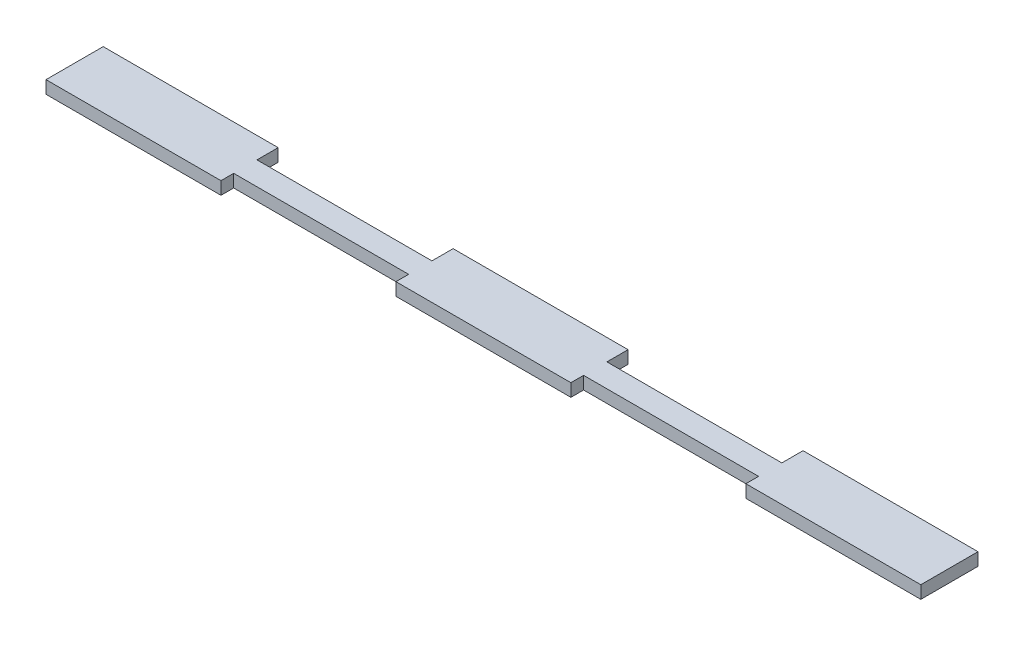
ISO-10303-21;
HEADER;
FILE_DESCRIPTION(('STEP AP214'),'2;1');
FILE_NAME('part.step','',(''),(''),'','','');
FILE_SCHEMA(('AUTOMOTIVE_DESIGN { 1 0 10303 214 1 1 1 1 }'));
ENDSEC;
DATA;
#1=APPLICATION_CONTEXT('core data for automotive mechanical design processes');
#2=APPLICATION_PROTOCOL_DEFINITION('international standard','automotive_design',2000,#1);
#3=PRODUCT_CONTEXT('',#1,'mechanical');
#4=PRODUCT('Part','Part','',(#3));
#5=PRODUCT_RELATED_PRODUCT_CATEGORY('part','',(#4));
#6=PRODUCT_DEFINITION_FORMATION('','',#4);
#7=PRODUCT_DEFINITION_CONTEXT('part definition',#1,'design');
#8=PRODUCT_DEFINITION('design','',#6,#7);
#9=PRODUCT_DEFINITION_SHAPE('','',#8);
#10=(LENGTH_UNIT() NAMED_UNIT(*) SI_UNIT(.MILLI.,.METRE.));
#11=(NAMED_UNIT(*) PLANE_ANGLE_UNIT() SI_UNIT($,.RADIAN.));
#12=(NAMED_UNIT(*) SI_UNIT($,.STERADIAN.) SOLID_ANGLE_UNIT());
#13=UNCERTAINTY_MEASURE_WITH_UNIT(LENGTH_MEASURE(1.E-05),#10,'distance_accuracy_value','');
#14=(GEOMETRIC_REPRESENTATION_CONTEXT(3) GLOBAL_UNCERTAINTY_ASSIGNED_CONTEXT((#13)) GLOBAL_UNIT_ASSIGNED_CONTEXT((#10,
#11,#12)) REPRESENTATION_CONTEXT('',''));
#15=CARTESIAN_POINT('',(0.,0.,0.));
#16=DIRECTION('',(0.,0.,1.));
#17=DIRECTION('',(1.,0.,0.));
#18=AXIS2_PLACEMENT_3D('',#15,#16,#17);
#19=CARTESIAN_POINT('',(61.9499999999999,3.,6.75));
#20=DIRECTION('',(0.,0.,-1.));
#21=DIRECTION('',(-1.,0.,0.));
#22=AXIS2_PLACEMENT_3D('',#19,#20,#21);
#23=PLANE('',#22);
#24=DIRECTION('',(1.,0.,0.));
#25=VECTOR('',#24,1.);
#26=CARTESIAN_POINT('',(61.9499999999999,0.,6.75));
#27=LINE('',#26,#25);
#28=CARTESIAN_POINT('',(61.9499999999999,0.,6.75));
#29=VERTEX_POINT('',#28);
#30=CARTESIAN_POINT('',(103.25,0.,6.75));
#31=VERTEX_POINT('',#30);
#32=EDGE_CURVE('E201',#29,#31,#27,.T.);
#33=ORIENTED_EDGE('',*,*,#32,.T.);
#34=DIRECTION('',(0.,-1.,0.));
#35=VECTOR('',#34,1.);
#36=CARTESIAN_POINT('',(103.25,3.,6.75));
#37=LINE('',#36,#35);
#38=CARTESIAN_POINT('',(103.25,3.,6.75));
#39=VERTEX_POINT('',#38);
#40=EDGE_CURVE('E11',#39,#31,#37,.T.);
#41=ORIENTED_EDGE('',*,*,#40,.F.);
#42=DIRECTION('',(1.,0.,0.));
#43=VECTOR('',#42,1.);
#44=CARTESIAN_POINT('',(61.9499999999999,3.,6.75));
#45=LINE('',#44,#43);
#46=CARTESIAN_POINT('',(61.9499999999999,3.,6.75));
#47=VERTEX_POINT('',#46);
#48=EDGE_CURVE('E239',#47,#39,#45,.T.);
#49=ORIENTED_EDGE('',*,*,#48,.F.);
#50=DIRECTION('',(0.,-1.,0.));
#51=VECTOR('',#50,1.);
#52=CARTESIAN_POINT('',(61.9499999999999,3.,6.75));
#53=LINE('',#52,#51);
#54=EDGE_CURVE('E197',#47,#29,#53,.T.);
#55=ORIENTED_EDGE('',*,*,#54,.T.);
#56=EDGE_LOOP('',(#33,#41,#49,#55));
#57=FACE_BOUND('',#56,.T.);
#58=ADVANCED_FACE('F33',(#57),#23,.F.);
#59=CARTESIAN_POINT('',(103.25,3.,-6.75));
#60=DIRECTION('',(-1.,0.,0.));
#61=DIRECTION('',(0.,0.,1.));
#62=AXIS2_PLACEMENT_3D('',#59,#60,#61);
#63=PLANE('',#62);
#64=DIRECTION('',(0.,0.,-1.));
#65=VECTOR('',#64,1.);
#66=CARTESIAN_POINT('',(103.25,0.,-6.75));
#67=LINE('',#66,#65);
#68=CARTESIAN_POINT('',(103.25,0.,-6.75));
#69=VERTEX_POINT('',#68);
#70=EDGE_CURVE('E204',#31,#69,#67,.T.);
#71=ORIENTED_EDGE('',*,*,#70,.T.);
#72=DIRECTION('',(0.,-1.,0.));
#73=VECTOR('',#72,1.);
#74=CARTESIAN_POINT('',(103.25,3.,-6.75));
#75=LINE('',#74,#73);
#76=CARTESIAN_POINT('',(103.25,3.,-6.75));
#77=VERTEX_POINT('',#76);
#78=EDGE_CURVE('E41',#77,#69,#75,.T.);
#79=ORIENTED_EDGE('',*,*,#78,.F.);
#80=DIRECTION('',(0.,0.,-1.));
#81=VECTOR('',#80,1.);
#82=CARTESIAN_POINT('',(103.25,3.,-6.75));
#83=LINE('',#82,#81);
#84=EDGE_CURVE('E128',#39,#77,#83,.T.);
#85=ORIENTED_EDGE('',*,*,#84,.F.);
#86=ORIENTED_EDGE('',*,*,#40,.T.);
#87=EDGE_LOOP('',(#71,#79,#85,#86));
#88=FACE_BOUND('',#87,.T.);
#89=ADVANCED_FACE('F357',(#88),#63,.F.);
#90=CARTESIAN_POINT('',(61.9499999999999,3.,-6.75));
#91=DIRECTION('',(0.,0.,1.));
#92=DIRECTION('',(1.,0.,0.));
#93=AXIS2_PLACEMENT_3D('',#90,#91,#92);
#94=PLANE('',#93);
#95=DIRECTION('',(-1.,0.,0.));
#96=VECTOR('',#95,1.);
#97=CARTESIAN_POINT('',(61.9499999999999,0.,-6.75));
#98=LINE('',#97,#96);
#99=CARTESIAN_POINT('',(61.9499999999999,0.,-6.75));
#100=VERTEX_POINT('',#99);
#101=EDGE_CURVE('E206',#69,#100,#98,.T.);
#102=ORIENTED_EDGE('',*,*,#101,.T.);
#103=DIRECTION('',(0.,-1.,0.));
#104=VECTOR('',#103,1.);
#105=CARTESIAN_POINT('',(61.9499999999999,3.,-6.75));
#106=LINE('',#105,#104);
#107=CARTESIAN_POINT('',(61.9499999999999,3.,-6.75));
#108=VERTEX_POINT('',#107);
#109=EDGE_CURVE('E282',#108,#100,#106,.T.);
#110=ORIENTED_EDGE('',*,*,#109,.F.);
#111=DIRECTION('',(-1.,0.,0.));
#112=VECTOR('',#111,1.);
#113=CARTESIAN_POINT('',(61.9499999999999,3.,-6.75));
#114=LINE('',#113,#112);
#115=EDGE_CURVE('E290',#77,#108,#114,.T.);
#116=ORIENTED_EDGE('',*,*,#115,.F.);
#117=ORIENTED_EDGE('',*,*,#78,.T.);
#118=EDGE_LOOP('',(#102,#110,#116,#117));
#119=FACE_BOUND('',#118,.T.);
#120=ADVANCED_FACE('F288',(#119),#94,.F.);
#121=CARTESIAN_POINT('',(61.9499999999999,3.,-6.75));
#122=DIRECTION('',(1.,0.,0.));
#123=DIRECTION('',(0.,0.,-1.));
#124=AXIS2_PLACEMENT_3D('',#121,#122,#123);
#125=PLANE('',#124);
#126=DIRECTION('',(0.,0.,1.));
#127=VECTOR('',#126,1.);
#128=CARTESIAN_POINT('',(61.9499999999999,0.,-6.75));
#129=LINE('',#128,#127);
#130=CARTESIAN_POINT('',(61.9499999999999,0.,-1.75));
#131=VERTEX_POINT('',#130);
#132=EDGE_CURVE('E208',#100,#131,#129,.T.);
#133=ORIENTED_EDGE('',*,*,#132,.T.);
#134=DIRECTION('',(0.,-1.,0.));
#135=VECTOR('',#134,1.);
#136=CARTESIAN_POINT('',(61.9499999999999,3.,-1.75));
#137=LINE('',#136,#135);
#138=CARTESIAN_POINT('',(61.9499999999999,3.,-1.75));
#139=VERTEX_POINT('',#138);
#140=EDGE_CURVE('E279',#139,#131,#137,.T.);
#141=ORIENTED_EDGE('',*,*,#140,.F.);
#142=DIRECTION('',(0.,0.,1.));
#143=VECTOR('',#142,1.);
#144=CARTESIAN_POINT('',(61.9499999999999,3.,-6.75));
#145=LINE('',#144,#143);
#146=EDGE_CURVE('E308',#108,#139,#145,.T.);
#147=ORIENTED_EDGE('',*,*,#146,.F.);
#148=ORIENTED_EDGE('',*,*,#109,.T.);
#149=EDGE_LOOP('',(#133,#141,#147,#148));
#150=FACE_BOUND('',#149,.T.);
#151=ADVANCED_FACE('F299',(#150),#125,.F.);
#152=CARTESIAN_POINT('',(20.65,3.,-1.75));
#153=DIRECTION('',(0.,0.,1.));
#154=DIRECTION('',(1.,0.,0.));
#155=AXIS2_PLACEMENT_3D('',#152,#153,#154);
#156=PLANE('',#155);
#157=DIRECTION('',(-1.,0.,0.));
#158=VECTOR('',#157,1.);
#159=CARTESIAN_POINT('',(20.65,0.,-1.75));
#160=LINE('',#159,#158);
#161=CARTESIAN_POINT('',(20.65,0.,-1.75));
#162=VERTEX_POINT('',#161);
#163=EDGE_CURVE('E210',#131,#162,#160,.T.);
#164=ORIENTED_EDGE('',*,*,#163,.T.);
#165=DIRECTION('',(0.,-1.,0.));
#166=VECTOR('',#165,1.);
#167=CARTESIAN_POINT('',(20.65,3.,-1.75));
#168=LINE('',#167,#166);
#169=CARTESIAN_POINT('',(20.65,3.,-1.75));
#170=VERTEX_POINT('',#169);
#171=EDGE_CURVE('E276',#170,#162,#168,.T.);
#172=ORIENTED_EDGE('',*,*,#171,.F.);
#173=DIRECTION('',(-1.,0.,0.));
#174=VECTOR('',#173,1.);
#175=CARTESIAN_POINT('',(20.65,3.,-1.75));
#176=LINE('',#175,#174);
#177=EDGE_CURVE('E305',#139,#170,#176,.T.);
#178=ORIENTED_EDGE('',*,*,#177,.F.);
#179=ORIENTED_EDGE('',*,*,#140,.T.);
#180=EDGE_LOOP('',(#164,#172,#178,#179));
#181=FACE_BOUND('',#180,.T.);
#182=ADVANCED_FACE('F303',(#181),#156,.F.);
#183=CARTESIAN_POINT('',(20.65,3.,-6.75));
#184=DIRECTION('',(-1.,0.,0.));
#185=DIRECTION('',(0.,0.,1.));
#186=AXIS2_PLACEMENT_3D('',#183,#184,#185);
#187=PLANE('',#186);
#188=DIRECTION('',(0.,0.,-1.));
#189=VECTOR('',#188,1.);
#190=CARTESIAN_POINT('',(20.65,0.,-6.75));
#191=LINE('',#190,#189);
#192=CARTESIAN_POINT('',(20.65,0.,-6.75));
#193=VERTEX_POINT('',#192);
#194=EDGE_CURVE('E212',#162,#193,#191,.T.);
#195=ORIENTED_EDGE('',*,*,#194,.T.);
#196=DIRECTION('',(0.,-1.,0.));
#197=VECTOR('',#196,1.);
#198=CARTESIAN_POINT('',(20.65,3.,-6.75));
#199=LINE('',#198,#197);
#200=CARTESIAN_POINT('',(20.65,3.,-6.75));
#201=VERTEX_POINT('',#200);
#202=EDGE_CURVE('E273',#201,#193,#199,.T.);
#203=ORIENTED_EDGE('',*,*,#202,.F.);
#204=DIRECTION('',(0.,0.,-1.));
#205=VECTOR('',#204,1.);
#206=CARTESIAN_POINT('',(20.65,3.,-6.75));
#207=LINE('',#206,#205);
#208=EDGE_CURVE('E307',#170,#201,#207,.T.);
#209=ORIENTED_EDGE('',*,*,#208,.F.);
#210=ORIENTED_EDGE('',*,*,#171,.T.);
#211=EDGE_LOOP('',(#195,#203,#209,#210));
#212=FACE_BOUND('',#211,.T.);
#213=ADVANCED_FACE('F370',(#212),#187,.F.);
#214=CARTESIAN_POINT('',(-20.65,3.,-6.75));
#215=DIRECTION('',(0.,0.,1.));
#216=DIRECTION('',(1.,0.,0.));
#217=AXIS2_PLACEMENT_3D('',#214,#215,#216);
#218=PLANE('',#217);
#219=DIRECTION('',(-1.,0.,0.));
#220=VECTOR('',#219,1.);
#221=CARTESIAN_POINT('',(-20.65,0.,-6.75));
#222=LINE('',#221,#220);
#223=CARTESIAN_POINT('',(-20.65,0.,-6.75));
#224=VERTEX_POINT('',#223);
#225=EDGE_CURVE('E214',#193,#224,#222,.T.);
#226=ORIENTED_EDGE('',*,*,#225,.T.);
#227=DIRECTION('',(0.,-1.,0.));
#228=VECTOR('',#227,1.);
#229=CARTESIAN_POINT('',(-20.65,3.,-6.75));
#230=LINE('',#229,#228);
#231=CARTESIAN_POINT('',(-20.65,3.,-6.75));
#232=VERTEX_POINT('',#231);
#233=EDGE_CURVE('E270',#232,#224,#230,.T.);
#234=ORIENTED_EDGE('',*,*,#233,.F.);
#235=DIRECTION('',(-1.,0.,0.));
#236=VECTOR('',#235,1.);
#237=CARTESIAN_POINT('',(-20.65,3.,-6.75));
#238=LINE('',#237,#236);
#239=EDGE_CURVE('E310',#201,#232,#238,.T.);
#240=ORIENTED_EDGE('',*,*,#239,.F.);
#241=ORIENTED_EDGE('',*,*,#202,.T.);
#242=EDGE_LOOP('',(#226,#234,#240,#241));
#243=FACE_BOUND('',#242,.T.);
#244=ADVANCED_FACE('F373',(#243),#218,.F.);
#245=CARTESIAN_POINT('',(-20.65,3.,-6.75));
#246=DIRECTION('',(1.,0.,0.));
#247=DIRECTION('',(0.,0.,-1.));
#248=AXIS2_PLACEMENT_3D('',#245,#246,#247);
#249=PLANE('',#248);
#250=DIRECTION('',(0.,0.,1.));
#251=VECTOR('',#250,1.);
#252=CARTESIAN_POINT('',(-20.65,0.,-6.75));
#253=LINE('',#252,#251);
#254=CARTESIAN_POINT('',(-20.65,0.,-1.75));
#255=VERTEX_POINT('',#254);
#256=EDGE_CURVE('E216',#224,#255,#253,.T.);
#257=ORIENTED_EDGE('',*,*,#256,.T.);
#258=DIRECTION('',(0.,-1.,0.));
#259=VECTOR('',#258,1.);
#260=CARTESIAN_POINT('',(-20.65,3.,-1.75));
#261=LINE('',#260,#259);
#262=CARTESIAN_POINT('',(-20.65,3.,-1.75));
#263=VERTEX_POINT('',#262);
#264=EDGE_CURVE('E267',#263,#255,#261,.T.);
#265=ORIENTED_EDGE('',*,*,#264,.F.);
#266=DIRECTION('',(0.,0.,1.));
#267=VECTOR('',#266,1.);
#268=CARTESIAN_POINT('',(-20.65,3.,-6.75));
#269=LINE('',#268,#267);
#270=EDGE_CURVE('E316',#232,#263,#269,.T.);
#271=ORIENTED_EDGE('',*,*,#270,.F.);
#272=ORIENTED_EDGE('',*,*,#233,.T.);
#273=EDGE_LOOP('',(#257,#265,#271,#272));
#274=FACE_BOUND('',#273,.T.);
#275=ADVANCED_FACE('F377',(#274),#249,.F.);
#276=CARTESIAN_POINT('',(-61.95,3.,-1.75));
#277=DIRECTION('',(0.,0.,1.));
#278=DIRECTION('',(1.,0.,0.));
#279=AXIS2_PLACEMENT_3D('',#276,#277,#278);
#280=PLANE('',#279);
#281=DIRECTION('',(-1.,0.,0.));
#282=VECTOR('',#281,1.);
#283=CARTESIAN_POINT('',(-61.95,0.,-1.75));
#284=LINE('',#283,#282);
#285=CARTESIAN_POINT('',(-61.95,0.,-1.75));
#286=VERTEX_POINT('',#285);
#287=EDGE_CURVE('E218',#255,#286,#284,.T.);
#288=ORIENTED_EDGE('',*,*,#287,.T.);
#289=DIRECTION('',(0.,-1.,0.));
#290=VECTOR('',#289,1.);
#291=CARTESIAN_POINT('',(-61.95,3.,-1.75));
#292=LINE('',#291,#290);
#293=CARTESIAN_POINT('',(-61.95,3.,-1.75));
#294=VERTEX_POINT('',#293);
#295=EDGE_CURVE('E264',#294,#286,#292,.T.);
#296=ORIENTED_EDGE('',*,*,#295,.F.);
#297=DIRECTION('',(-1.,0.,0.));
#298=VECTOR('',#297,1.);
#299=CARTESIAN_POINT('',(-61.95,3.,-1.75));
#300=LINE('',#299,#298);
#301=EDGE_CURVE('E318',#263,#294,#300,.T.);
#302=ORIENTED_EDGE('',*,*,#301,.F.);
#303=ORIENTED_EDGE('',*,*,#264,.T.);
#304=EDGE_LOOP('',(#288,#296,#302,#303));
#305=FACE_BOUND('',#304,.T.);
#306=ADVANCED_FACE('F381',(#305),#280,.F.);
#307=CARTESIAN_POINT('',(-61.95,3.,-6.75));
#308=DIRECTION('',(-1.,0.,0.));
#309=DIRECTION('',(0.,0.,1.));
#310=AXIS2_PLACEMENT_3D('',#307,#308,#309);
#311=PLANE('',#310);
#312=DIRECTION('',(0.,0.,-1.));
#313=VECTOR('',#312,1.);
#314=CARTESIAN_POINT('',(-61.95,0.,-6.75));
#315=LINE('',#314,#313);
#316=CARTESIAN_POINT('',(-61.95,0.,-6.75));
#317=VERTEX_POINT('',#316);
#318=EDGE_CURVE('E220',#286,#317,#315,.T.);
#319=ORIENTED_EDGE('',*,*,#318,.T.);
#320=DIRECTION('',(0.,-1.,0.));
#321=VECTOR('',#320,1.);
#322=CARTESIAN_POINT('',(-61.95,3.,-6.75));
#323=LINE('',#322,#321);
#324=CARTESIAN_POINT('',(-61.95,3.,-6.75));
#325=VERTEX_POINT('',#324);
#326=EDGE_CURVE('E261',#325,#317,#323,.T.);
#327=ORIENTED_EDGE('',*,*,#326,.F.);
#328=DIRECTION('',(0.,0.,-1.));
#329=VECTOR('',#328,1.);
#330=CARTESIAN_POINT('',(-61.95,3.,-6.75));
#331=LINE('',#330,#329);
#332=EDGE_CURVE('E320',#294,#325,#331,.T.);
#333=ORIENTED_EDGE('',*,*,#332,.F.);
#334=ORIENTED_EDGE('',*,*,#295,.T.);
#335=EDGE_LOOP('',(#319,#327,#333,#334));
#336=FACE_BOUND('',#335,.T.);
#337=ADVANCED_FACE('F385',(#336),#311,.F.);
#338=CARTESIAN_POINT('',(-103.25,3.,-6.75));
#339=DIRECTION('',(0.,0.,1.));
#340=DIRECTION('',(1.,0.,0.));
#341=AXIS2_PLACEMENT_3D('',#338,#339,#340);
#342=PLANE('',#341);
#343=DIRECTION('',(-1.,0.,0.));
#344=VECTOR('',#343,1.);
#345=CARTESIAN_POINT('',(-103.25,0.,-6.75));
#346=LINE('',#345,#344);
#347=CARTESIAN_POINT('',(-103.25,0.,-6.75));
#348=VERTEX_POINT('',#347);
#349=EDGE_CURVE('E222',#317,#348,#346,.T.);
#350=ORIENTED_EDGE('',*,*,#349,.T.);
#351=DIRECTION('',(0.,-1.,0.));
#352=VECTOR('',#351,1.);
#353=CARTESIAN_POINT('',(-103.25,3.,-6.75));
#354=LINE('',#353,#352);
#355=CARTESIAN_POINT('',(-103.25,3.,-6.75));
#356=VERTEX_POINT('',#355);
#357=EDGE_CURVE('E258',#356,#348,#354,.T.);
#358=ORIENTED_EDGE('',*,*,#357,.F.);
#359=DIRECTION('',(-1.,0.,0.));
#360=VECTOR('',#359,1.);
#361=CARTESIAN_POINT('',(-103.25,3.,-6.75));
#362=LINE('',#361,#360);
#363=EDGE_CURVE('E322',#325,#356,#362,.T.);
#364=ORIENTED_EDGE('',*,*,#363,.F.);
#365=ORIENTED_EDGE('',*,*,#326,.T.);
#366=EDGE_LOOP('',(#350,#358,#364,#365));
#367=FACE_BOUND('',#366,.T.);
#368=ADVANCED_FACE('F389',(#367),#342,.F.);
#369=CARTESIAN_POINT('',(-103.25,3.,-6.75));
#370=DIRECTION('',(1.,0.,0.));
#371=DIRECTION('',(0.,0.,-1.));
#372=AXIS2_PLACEMENT_3D('',#369,#370,#371);
#373=PLANE('',#372);
#374=DIRECTION('',(0.,0.,1.));
#375=VECTOR('',#374,1.);
#376=CARTESIAN_POINT('',(-103.25,0.,-6.75));
#377=LINE('',#376,#375);
#378=CARTESIAN_POINT('',(-103.25,0.,6.75));
#379=VERTEX_POINT('',#378);
#380=EDGE_CURVE('E224',#348,#379,#377,.T.);
#381=ORIENTED_EDGE('',*,*,#380,.T.);
#382=DIRECTION('',(0.,-1.,0.));
#383=VECTOR('',#382,1.);
#384=CARTESIAN_POINT('',(-103.25,3.,6.75));
#385=LINE('',#384,#383);
#386=CARTESIAN_POINT('',(-103.25,3.,6.75));
#387=VERTEX_POINT('',#386);
#388=EDGE_CURVE('E255',#387,#379,#385,.T.);
#389=ORIENTED_EDGE('',*,*,#388,.F.);
#390=DIRECTION('',(0.,0.,1.));
#391=VECTOR('',#390,1.);
#392=CARTESIAN_POINT('',(-103.25,3.,-6.75));
#393=LINE('',#392,#391);
#394=EDGE_CURVE('E324',#356,#387,#393,.T.);
#395=ORIENTED_EDGE('',*,*,#394,.F.);
#396=ORIENTED_EDGE('',*,*,#357,.T.);
#397=EDGE_LOOP('',(#381,#389,#395,#396));
#398=FACE_BOUND('',#397,.T.);
#399=ADVANCED_FACE('F393',(#398),#373,.F.);
#400=CARTESIAN_POINT('',(-103.25,3.,6.75));
#401=DIRECTION('',(0.,0.,-1.));
#402=DIRECTION('',(-1.,0.,0.));
#403=AXIS2_PLACEMENT_3D('',#400,#401,#402);
#404=PLANE('',#403);
#405=DIRECTION('',(1.,0.,0.));
#406=VECTOR('',#405,1.);
#407=CARTESIAN_POINT('',(-103.25,0.,6.75));
#408=LINE('',#407,#406);
#409=CARTESIAN_POINT('',(-61.95,0.,6.75));
#410=VERTEX_POINT('',#409);
#411=EDGE_CURVE('E226',#379,#410,#408,.T.);
#412=ORIENTED_EDGE('',*,*,#411,.T.);
#413=DIRECTION('',(0.,-1.,0.));
#414=VECTOR('',#413,1.);
#415=CARTESIAN_POINT('',(-61.95,3.,6.75));
#416=LINE('',#415,#414);
#417=CARTESIAN_POINT('',(-61.95,3.,6.75));
#418=VERTEX_POINT('',#417);
#419=EDGE_CURVE('E252',#418,#410,#416,.T.);
#420=ORIENTED_EDGE('',*,*,#419,.F.);
#421=DIRECTION('',(1.,0.,0.));
#422=VECTOR('',#421,1.);
#423=CARTESIAN_POINT('',(-103.25,3.,6.75));
#424=LINE('',#423,#422);
#425=EDGE_CURVE('E326',#387,#418,#424,.T.);
#426=ORIENTED_EDGE('',*,*,#425,.F.);
#427=ORIENTED_EDGE('',*,*,#388,.T.);
#428=EDGE_LOOP('',(#412,#420,#426,#427));
#429=FACE_BOUND('',#428,.T.);
#430=ADVANCED_FACE('F397',(#429),#404,.F.);
#431=CARTESIAN_POINT('',(-61.95,3.,3.75));
#432=DIRECTION('',(-1.,0.,0.));
#433=DIRECTION('',(0.,0.,1.));
#434=AXIS2_PLACEMENT_3D('',#431,#432,#433);
#435=PLANE('',#434);
#436=DIRECTION('',(0.,0.,-1.));
#437=VECTOR('',#436,1.);
#438=CARTESIAN_POINT('',(-61.95,0.,3.75));
#439=LINE('',#438,#437);
#440=CARTESIAN_POINT('',(-61.95,0.,3.75));
#441=VERTEX_POINT('',#440);
#442=EDGE_CURVE('E228',#410,#441,#439,.T.);
#443=ORIENTED_EDGE('',*,*,#442,.T.);
#444=DIRECTION('',(0.,-1.,0.));
#445=VECTOR('',#444,1.);
#446=CARTESIAN_POINT('',(-61.95,3.,3.75));
#447=LINE('',#446,#445);
#448=CARTESIAN_POINT('',(-61.95,3.,3.75));
#449=VERTEX_POINT('',#448);
#450=EDGE_CURVE('E249',#449,#441,#447,.T.);
#451=ORIENTED_EDGE('',*,*,#450,.F.);
#452=DIRECTION('',(0.,0.,-1.));
#453=VECTOR('',#452,1.);
#454=CARTESIAN_POINT('',(-61.95,3.,3.75));
#455=LINE('',#454,#453);
#456=EDGE_CURVE('E328',#418,#449,#455,.T.);
#457=ORIENTED_EDGE('',*,*,#456,.F.);
#458=ORIENTED_EDGE('',*,*,#419,.T.);
#459=EDGE_LOOP('',(#443,#451,#457,#458));
#460=FACE_BOUND('',#459,.T.);
#461=ADVANCED_FACE('F401',(#460),#435,.F.);
#462=CARTESIAN_POINT('',(-61.95,3.,3.75));
#463=DIRECTION('',(0.,0.,-1.));
#464=DIRECTION('',(-1.,0.,0.));
#465=AXIS2_PLACEMENT_3D('',#462,#463,#464);
#466=PLANE('',#465);
#467=DIRECTION('',(1.,0.,0.));
#468=VECTOR('',#467,1.);
#469=CARTESIAN_POINT('',(-61.95,0.,3.75));
#470=LINE('',#469,#468);
#471=CARTESIAN_POINT('',(-20.65,0.,3.75));
#472=VERTEX_POINT('',#471);
#473=EDGE_CURVE('E230',#441,#472,#470,.T.);
#474=ORIENTED_EDGE('',*,*,#473,.T.);
#475=DIRECTION('',(0.,-1.,0.));
#476=VECTOR('',#475,1.);
#477=CARTESIAN_POINT('',(-20.65,3.,3.75));
#478=LINE('',#477,#476);
#479=CARTESIAN_POINT('',(-20.65,3.,3.75));
#480=VERTEX_POINT('',#479);
#481=EDGE_CURVE('E246',#480,#472,#478,.T.);
#482=ORIENTED_EDGE('',*,*,#481,.F.);
#483=DIRECTION('',(1.,0.,0.));
#484=VECTOR('',#483,1.);
#485=CARTESIAN_POINT('',(-61.95,3.,3.75));
#486=LINE('',#485,#484);
#487=EDGE_CURVE('E330',#449,#480,#486,.T.);
#488=ORIENTED_EDGE('',*,*,#487,.F.);
#489=ORIENTED_EDGE('',*,*,#450,.T.);
#490=EDGE_LOOP('',(#474,#482,#488,#489));
#491=FACE_BOUND('',#490,.T.);
#492=ADVANCED_FACE('F405',(#491),#466,.F.);
#493=CARTESIAN_POINT('',(-20.65,3.,3.75));
#494=DIRECTION('',(1.,0.,0.));
#495=DIRECTION('',(0.,0.,-1.));
#496=AXIS2_PLACEMENT_3D('',#493,#494,#495);
#497=PLANE('',#496);
#498=DIRECTION('',(0.,0.,1.));
#499=VECTOR('',#498,1.);
#500=CARTESIAN_POINT('',(-20.65,0.,3.75));
#501=LINE('',#500,#499);
#502=CARTESIAN_POINT('',(-20.65,0.,6.75));
#503=VERTEX_POINT('',#502);
#504=EDGE_CURVE('E232',#472,#503,#501,.T.);
#505=ORIENTED_EDGE('',*,*,#504,.T.);
#506=DIRECTION('',(0.,-1.,0.));
#507=VECTOR('',#506,1.);
#508=CARTESIAN_POINT('',(-20.65,3.,6.75));
#509=LINE('',#508,#507);
#510=CARTESIAN_POINT('',(-20.65,3.,6.75));
#511=VERTEX_POINT('',#510);
#512=EDGE_CURVE('E243',#511,#503,#509,.T.);
#513=ORIENTED_EDGE('',*,*,#512,.F.);
#514=DIRECTION('',(0.,0.,1.));
#515=VECTOR('',#514,1.);
#516=CARTESIAN_POINT('',(-20.65,3.,3.75));
#517=LINE('',#516,#515);
#518=EDGE_CURVE('E332',#480,#511,#517,.T.);
#519=ORIENTED_EDGE('',*,*,#518,.F.);
#520=ORIENTED_EDGE('',*,*,#481,.T.);
#521=EDGE_LOOP('',(#505,#513,#519,#520));
#522=FACE_BOUND('',#521,.T.);
#523=ADVANCED_FACE('F338',(#522),#497,.F.);
#524=CARTESIAN_POINT('',(-20.65,3.,6.75));
#525=DIRECTION('',(0.,0.,-1.));
#526=DIRECTION('',(-1.,0.,0.));
#527=AXIS2_PLACEMENT_3D('',#524,#525,#526);
#528=PLANE('',#527);
#529=DIRECTION('',(1.,0.,0.));
#530=VECTOR('',#529,1.);
#531=CARTESIAN_POINT('',(-20.65,0.,6.75));
#532=LINE('',#531,#530);
#533=CARTESIAN_POINT('',(20.65,0.,6.75));
#534=VERTEX_POINT('',#533);
#535=EDGE_CURVE('E234',#503,#534,#532,.T.);
#536=ORIENTED_EDGE('',*,*,#535,.T.);
#537=DIRECTION('',(0.,-1.,0.));
#538=VECTOR('',#537,1.);
#539=CARTESIAN_POINT('',(20.65,3.,6.75));
#540=LINE('',#539,#538);
#541=CARTESIAN_POINT('',(20.65,3.,6.75));
#542=VERTEX_POINT('',#541);
#543=EDGE_CURVE('E192',#542,#534,#540,.T.);
#544=ORIENTED_EDGE('',*,*,#543,.F.);
#545=DIRECTION('',(1.,0.,0.));
#546=VECTOR('',#545,1.);
#547=CARTESIAN_POINT('',(-20.65,3.,6.75));
#548=LINE('',#547,#546);
#549=EDGE_CURVE('E183',#511,#542,#548,.T.);
#550=ORIENTED_EDGE('',*,*,#549,.F.);
#551=ORIENTED_EDGE('',*,*,#512,.T.);
#552=EDGE_LOOP('',(#536,#544,#550,#551));
#553=FACE_BOUND('',#552,.T.);
#554=ADVANCED_FACE('F342',(#553),#528,.F.);
#555=CARTESIAN_POINT('',(20.65,3.,3.75));
#556=DIRECTION('',(-1.,0.,0.));
#557=DIRECTION('',(0.,0.,1.));
#558=AXIS2_PLACEMENT_3D('',#555,#556,#557);
#559=PLANE('',#558);
#560=DIRECTION('',(0.,0.,-1.));
#561=VECTOR('',#560,1.);
#562=CARTESIAN_POINT('',(20.65,0.,3.75));
#563=LINE('',#562,#561);
#564=CARTESIAN_POINT('',(20.65,0.,3.75));
#565=VERTEX_POINT('',#564);
#566=EDGE_CURVE('E191',#534,#565,#563,.T.);
#567=ORIENTED_EDGE('',*,*,#566,.T.);
#568=DIRECTION('',(0.,-1.,0.));
#569=VECTOR('',#568,1.);
#570=CARTESIAN_POINT('',(20.65,3.,3.75));
#571=LINE('',#570,#569);
#572=CARTESIAN_POINT('',(20.65,3.,3.75));
#573=VERTEX_POINT('',#572);
#574=EDGE_CURVE('E188',#573,#565,#571,.T.);
#575=ORIENTED_EDGE('',*,*,#574,.F.);
#576=DIRECTION('',(0.,0.,-1.));
#577=VECTOR('',#576,1.);
#578=CARTESIAN_POINT('',(20.65,3.,3.75));
#579=LINE('',#578,#577);
#580=EDGE_CURVE('E177',#542,#573,#579,.T.);
#581=ORIENTED_EDGE('',*,*,#580,.F.);
#582=ORIENTED_EDGE('',*,*,#543,.T.);
#583=EDGE_LOOP('',(#567,#575,#581,#582));
#584=FACE_BOUND('',#583,.T.);
#585=ADVANCED_FACE('F189',(#584),#559,.F.);
#586=CARTESIAN_POINT('',(20.65,3.,3.75));
#587=DIRECTION('',(0.,0.,-1.));
#588=DIRECTION('',(-1.,0.,0.));
#589=AXIS2_PLACEMENT_3D('',#586,#587,#588);
#590=PLANE('',#589);
#591=DIRECTION('',(1.,0.,0.));
#592=VECTOR('',#591,1.);
#593=CARTESIAN_POINT('',(20.65,0.,3.75));
#594=LINE('',#593,#592);
#595=CARTESIAN_POINT('',(61.9499999999999,0.,3.75));
#596=VERTEX_POINT('',#595);
#597=EDGE_CURVE('E114',#565,#596,#594,.T.);
#598=ORIENTED_EDGE('',*,*,#597,.T.);
#599=DIRECTION('',(0.,-1.,0.));
#600=VECTOR('',#599,1.);
#601=CARTESIAN_POINT('',(61.9499999999999,3.,3.75));
#602=LINE('',#601,#600);
#603=CARTESIAN_POINT('',(61.9499999999999,3.,3.75));
#604=VERTEX_POINT('',#603);
#605=EDGE_CURVE('E193',#604,#596,#602,.T.);
#606=ORIENTED_EDGE('',*,*,#605,.F.);
#607=DIRECTION('',(1.,0.,0.));
#608=VECTOR('',#607,1.);
#609=CARTESIAN_POINT('',(20.65,3.,3.75));
#610=LINE('',#609,#608);
#611=EDGE_CURVE('E181',#573,#604,#610,.T.);
#612=ORIENTED_EDGE('',*,*,#611,.F.);
#613=ORIENTED_EDGE('',*,*,#574,.T.);
#614=EDGE_LOOP('',(#598,#606,#612,#613));
#615=FACE_BOUND('',#614,.T.);
#616=ADVANCED_FACE('F195',(#615),#590,.F.);
#617=CARTESIAN_POINT('',(61.9499999999999,3.,3.75));
#618=DIRECTION('',(1.,0.,0.));
#619=DIRECTION('',(0.,0.,-1.));
#620=AXIS2_PLACEMENT_3D('',#617,#618,#619);
#621=PLANE('',#620);
#622=DIRECTION('',(0.,0.,1.));
#623=VECTOR('',#622,1.);
#624=CARTESIAN_POINT('',(61.9499999999999,0.,3.75));
#625=LINE('',#624,#623);
#626=EDGE_CURVE('E120',#596,#29,#625,.T.);
#627=ORIENTED_EDGE('',*,*,#626,.T.);
#628=ORIENTED_EDGE('',*,*,#54,.F.);
#629=DIRECTION('',(0.,0.,1.));
#630=VECTOR('',#629,1.);
#631=CARTESIAN_POINT('',(61.9499999999999,3.,3.75));
#632=LINE('',#631,#630);
#633=EDGE_CURVE('E49',#604,#47,#632,.T.);
#634=ORIENTED_EDGE('',*,*,#633,.F.);
#635=ORIENTED_EDGE('',*,*,#605,.T.);
#636=EDGE_LOOP('',(#627,#628,#634,#635));
#637=FACE_BOUND('',#636,.T.);
#638=ADVANCED_FACE('F346',(#637),#621,.F.);
#639=CARTESIAN_POINT('',(0.,3.,0.));
#640=DIRECTION('',(0.,-1.,0.));
#641=DIRECTION('',(0.,0.,-1.));
#642=AXIS2_PLACEMENT_3D('',#639,#640,#641);
#643=PLANE('',#642);
#644=ORIENTED_EDGE('',*,*,#48,.T.);
#645=ORIENTED_EDGE('',*,*,#84,.T.);
#646=ORIENTED_EDGE('',*,*,#115,.T.);
#647=ORIENTED_EDGE('',*,*,#146,.T.);
#648=ORIENTED_EDGE('',*,*,#177,.T.);
#649=ORIENTED_EDGE('',*,*,#208,.T.);
#650=ORIENTED_EDGE('',*,*,#239,.T.);
#651=ORIENTED_EDGE('',*,*,#270,.T.);
#652=ORIENTED_EDGE('',*,*,#301,.T.);
#653=ORIENTED_EDGE('',*,*,#332,.T.);
#654=ORIENTED_EDGE('',*,*,#363,.T.);
#655=ORIENTED_EDGE('',*,*,#394,.T.);
#656=ORIENTED_EDGE('',*,*,#425,.T.);
#657=ORIENTED_EDGE('',*,*,#456,.T.);
#658=ORIENTED_EDGE('',*,*,#487,.T.);
#659=ORIENTED_EDGE('',*,*,#518,.T.);
#660=ORIENTED_EDGE('',*,*,#549,.T.);
#661=ORIENTED_EDGE('',*,*,#580,.T.);
#662=ORIENTED_EDGE('',*,*,#611,.T.);
#663=ORIENTED_EDGE('',*,*,#633,.T.);
#664=EDGE_LOOP('',(#644,#645,#646,#647,#648,#649,#650,#651,#652,#653,#654,#655,#656,#657,#658,
#659,#660,#661,#662,#663));
#665=FACE_BOUND('',#664,.T.);
#666=ADVANCED_FACE('F179',(#665),#643,.F.);
#667=CARTESIAN_POINT('',(0.,0.,0.));
#668=DIRECTION('',(0.,-1.,0.));
#669=DIRECTION('',(0.,0.,-1.));
#670=AXIS2_PLACEMENT_3D('',#667,#668,#669);
#671=PLANE('',#670);
#672=ORIENTED_EDGE('',*,*,#32,.F.);
#673=ORIENTED_EDGE('',*,*,#626,.F.);
#674=ORIENTED_EDGE('',*,*,#597,.F.);
#675=ORIENTED_EDGE('',*,*,#566,.F.);
#676=ORIENTED_EDGE('',*,*,#535,.F.);
#677=ORIENTED_EDGE('',*,*,#504,.F.);
#678=ORIENTED_EDGE('',*,*,#473,.F.);
#679=ORIENTED_EDGE('',*,*,#442,.F.);
#680=ORIENTED_EDGE('',*,*,#411,.F.);
#681=ORIENTED_EDGE('',*,*,#380,.F.);
#682=ORIENTED_EDGE('',*,*,#349,.F.);
#683=ORIENTED_EDGE('',*,*,#318,.F.);
#684=ORIENTED_EDGE('',*,*,#287,.F.);
#685=ORIENTED_EDGE('',*,*,#256,.F.);
#686=ORIENTED_EDGE('',*,*,#225,.F.);
#687=ORIENTED_EDGE('',*,*,#194,.F.);
#688=ORIENTED_EDGE('',*,*,#163,.F.);
#689=ORIENTED_EDGE('',*,*,#132,.F.);
#690=ORIENTED_EDGE('',*,*,#101,.F.);
#691=ORIENTED_EDGE('',*,*,#70,.F.);
#692=EDGE_LOOP('',(#672,#673,#674,#675,#676,#677,#678,#679,#680,#681,#682,#683,#684,#685,#686,
#687,#688,#689,#690,#691));
#693=FACE_BOUND('',#692,.T.);
#694=ADVANCED_FACE('F294',(#693),#671,.T.);
#695=CLOSED_SHELL('',(#58,#89,#120,#151,#182,#213,#244,#275,#306,#337,#368,#399,#430,#461,#492,
#523,#554,#585,#616,#638,#666,#694));
#696=MANIFOLD_SOLID_BREP('B2',#695);
#697=ADVANCED_BREP_SHAPE_REPRESENTATION('',(#18,#696),#14);
#698=SHAPE_DEFINITION_REPRESENTATION(#9,#697);
ENDSEC;
END-ISO-10303-21;
